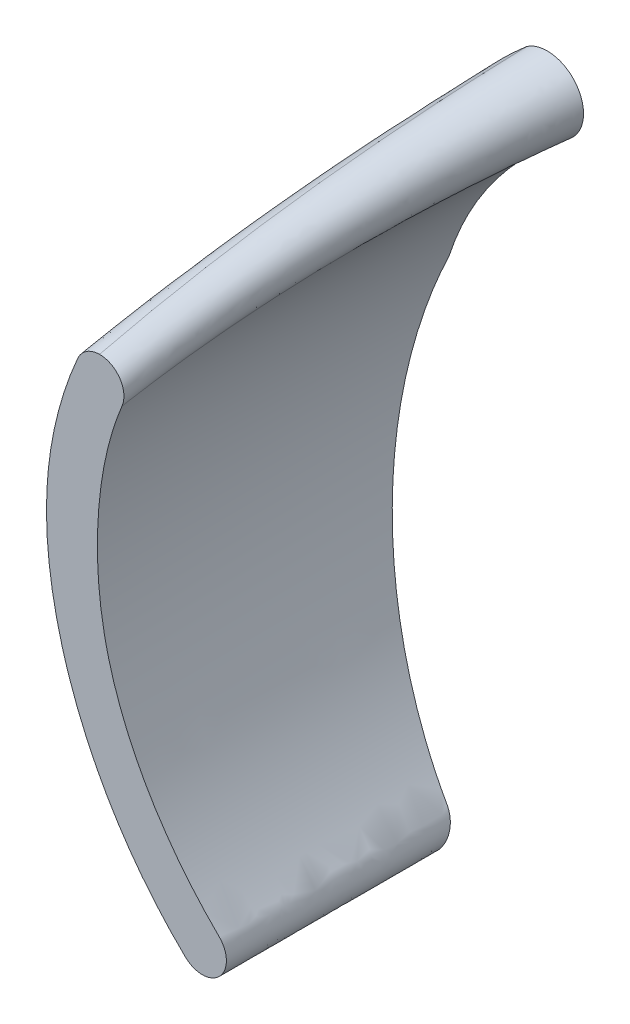
ISO-10303-21;
HEADER;
FILE_DESCRIPTION(('STEP AP214'),'2;1');
FILE_NAME('part.step','',(''),(''),'','','');
FILE_SCHEMA(('AUTOMOTIVE_DESIGN { 1 0 10303 214 1 1 1 1 }'));
ENDSEC;
DATA;
#1=APPLICATION_CONTEXT('core data for automotive mechanical design processes');
#2=APPLICATION_PROTOCOL_DEFINITION('international standard','automotive_design',2000,#1);
#3=PRODUCT_CONTEXT('',#1,'mechanical');
#4=PRODUCT('Part','Part','',(#3));
#5=PRODUCT_RELATED_PRODUCT_CATEGORY('part','',(#4));
#6=PRODUCT_DEFINITION_FORMATION('','',#4);
#7=PRODUCT_DEFINITION_CONTEXT('part definition',#1,'design');
#8=PRODUCT_DEFINITION('design','',#6,#7);
#9=PRODUCT_DEFINITION_SHAPE('','',#8);
#10=(LENGTH_UNIT() NAMED_UNIT(*) SI_UNIT(.MILLI.,.METRE.));
#11=(NAMED_UNIT(*) PLANE_ANGLE_UNIT() SI_UNIT($,.RADIAN.));
#12=(NAMED_UNIT(*) SI_UNIT($,.STERADIAN.) SOLID_ANGLE_UNIT());
#13=UNCERTAINTY_MEASURE_WITH_UNIT(LENGTH_MEASURE(1.E-05),#10,'distance_accuracy_value','');
#14=(GEOMETRIC_REPRESENTATION_CONTEXT(3) GLOBAL_UNCERTAINTY_ASSIGNED_CONTEXT((#13)) GLOBAL_UNIT_ASSIGNED_CONTEXT((#10,
#11,#12)) REPRESENTATION_CONTEXT('',''));
#15=CARTESIAN_POINT('',(0.,0.,0.));
#16=DIRECTION('',(0.,0.,1.));
#17=DIRECTION('',(1.,0.,0.));
#18=AXIS2_PLACEMENT_3D('',#15,#16,#17);
#19=CARTESIAN_POINT('',(2.21687202188998,-14.2030214101362,0.));
#20=DIRECTION('',(0.,0.,1.));
#21=DIRECTION('',(1.,0.,0.));
#22=AXIS2_PLACEMENT_3D('',#19,#20,#21);
#23=PLANE('',#22);
#24=DIRECTION('',(1.,0.,0.));
#25=VECTOR('',#24,1.);
#26=CARTESIAN_POINT('',(2.21687202188998,1.69042467703727,0.));
#27=LINE('',#26,#25);
#28=CARTESIAN_POINT('',(-3.8819149016798,1.69042465184301,4.33820491902333E-09));
#29=VERTEX_POINT('',#28);
#30=CARTESIAN_POINT('',(-1.56013684496183,1.69042461679714,8.41210645585731E-09));
#31=VERTEX_POINT('',#30);
#32=EDGE_CURVE('E165',#29,#31,#27,.T.);
#33=ORIENTED_EDGE('',*,*,#32,.F.);
#34=CARTESIAN_POINT('',(1.52540598499671,-14.9254303800577,0.));
#35=CARTESIAN_POINT('',(-5.20798473106547,-8.45325668751316,0.));
#36=CARTESIAN_POINT('',(-7.07906829862655,3.2983863051883,0.));
#37=CARTESIAN_POINT('',(1.65886001877747,10.8215877652023,0.));
#38=B_SPLINE_CURVE_WITH_KNOTS('',3,(#34,#35,#36,#37),.UNSPECIFIED.,.F.,.F.,(4,4),(0.,1.),.UNSPECIFIED.);
#39=CARTESIAN_POINT('',(0.387823292707398,9.62222518021847,0.));
#40=VERTEX_POINT('',#39);
#41=EDGE_CURVE('E152',#29,#40,#38,.T.);
#42=ORIENTED_EDGE('',*,*,#41,.T.);
#43=CARTESIAN_POINT('',(1.65886001877747,10.8215877652023,0.));
#44=CARTESIAN_POINT('',(0.995449500209707,10.2497020037202,0.));
#45=CARTESIAN_POINT('',(0.387823292707398,9.62222518021847,0.));
#46=B_SPLINE_CURVE_WITH_KNOTS('',2,(#43,#44,#45),.UNSPECIFIED.,.F.,.F.,(3,3),(0.,
0.0604558021560362),.UNSPECIFIED.);
#47=CARTESIAN_POINT('',(1.65886001877747,10.8215877652023,0.));
#48=VERTEX_POINT('',#47);
#49=EDGE_CURVE('E309',#48,#40,#46,.T.);
#50=ORIENTED_EDGE('',*,*,#49,.F.);
#51=CARTESIAN_POINT('',(2.5109062899188,9.58707686940826,0.));
#52=DIRECTION('',(0.,0.,1.));
#53=DIRECTION('',(1.,0.,0.));
#54=AXIS2_PLACEMENT_3D('',#51,#52,#53);
#55=CIRCLE('',#54,1.5);
#56=CARTESIAN_POINT('',(3.36295256106012,8.35256597361423,0.));
#57=VERTEX_POINT('',#56);
#58=EDGE_CURVE('E383',#57,#48,#55,.T.);
#59=ORIENTED_EDGE('',*,*,#58,.F.);
#60=CARTESIAN_POINT('',(2.90833805878325,-13.4806124402146,0.));
#61=CARTESIAN_POINT('',(-2.81888229836564,-7.93955339470696,0.));
#62=CARTESIAN_POINT('',(-4.96098367061801,2.05443070756396,0.));
#63=CARTESIAN_POINT('',(3.36295256106012,8.35256597361424,0.));
#64=B_SPLINE_CURVE_WITH_KNOTS('',3,(#60,#61,#62,#63),.UNSPECIFIED.,.F.,.F.,(4,4),(0.,1.),.UNSPECIFIED.);
#65=EDGE_CURVE('E214',#31,#57,#64,.T.);
#66=ORIENTED_EDGE('',*,*,#65,.F.);
#67=EDGE_LOOP('',(#33,#42,#50,#59,#66));
#68=FACE_BOUND('',#67,.T.);
#69=ADVANCED_FACE('F148',(#68),#23,.F.);
#70=CARTESIAN_POINT('',(3.09695483975418,8.77680093046163,14.));
#71=CARTESIAN_POINT('',(3.36295256106012,8.35256597361424,0.));
#72=CARTESIAN_POINT('',(2.24338395229223,8.16303354000813,14.));
#73=CARTESIAN_POINT('',(2.5260563368631,7.71934564648338,0.));
#74=CARTESIAN_POINT('',(1.07727132003301,7.07993421911677,14.));
#75=CARTESIAN_POINT('',(1.35618954109997,6.65779517127539,0.));
#76=CARTESIAN_POINT('',(-0.176649603936648,5.3794631820281,14.));
#77=CARTESIAN_POINT('',(0.0577721699250341,5.01122399532793,0.));
#78=CARTESIAN_POINT('',(-0.94652094021937,3.99168688441007,14.));
#79=CARTESIAN_POINT('',(-0.762015151465301,3.67190048743127,0.));
#80=CARTESIAN_POINT('',(-1.51667601951426,2.50959575800911,14.));
#81=CARTESIAN_POINT('',(-1.40445357046186,2.23937199883089,0.));
#82=CARTESIAN_POINT('',(-1.89196744893803,0.965970876940326,14.));
#83=CARTESIAN_POINT('',(-1.85921354343008,0.737902549588384,0.));
#84=CARTESIAN_POINT('',(-2.09652894437083,-0.608781701494442,14.));
#85=CARTESIAN_POINT('',(-2.11596552673539,-0.80824384023467,0.));
#86=CARTESIAN_POINT('',(-2.15363141823633,-2.1968936173405,14.));
#87=CARTESIAN_POINT('',(-2.18121208814721,-2.37420224861216,0.));
#88=CARTESIAN_POINT('',(-2.05653049628704,-3.78281689332909,14.));
#89=CARTESIAN_POINT('',(-2.06145579543495,-3.93510775351796,0.));
#90=CARTESIAN_POINT('',(-1.71206981463052,-5.87560706747711,14.));
#91=CARTESIAN_POINT('',(-1.67328879612149,-5.98661859099639,0.));
#92=CARTESIAN_POINT('',(-0.841451961703429,-8.39039678027985,14.));
#93=CARTESIAN_POINT('',(-0.793742398425718,-8.45227751253871,0.));
#94=CARTESIAN_POINT('',(0.776340476690976,-11.1367856006132,14.));
#95=CARTESIAN_POINT('',(0.79295937582964,-11.1628303118331,0.));
#96=CARTESIAN_POINT('',(2.15832181972896,-12.7463747640299,14.));
#97=CARTESIAN_POINT('',(2.15751829913113,-12.754197816483,0.));
#98=CARTESIAN_POINT('',(3.10189333899869,-13.6682314597512,14.));
#99=CARTESIAN_POINT('',(3.09644354137655,-13.6606608033749,0.));
#100=CARTESIAN_POINT('',(3.3260564074682,-14.1887841629831,14.));
#101=CARTESIAN_POINT('',(3.32485307122997,-14.1744049927266,0.));
#102=CARTESIAN_POINT('',(3.0103390635431,-14.9779618927495,14.));
#103=CARTESIAN_POINT('',(3.02125339240199,-14.9671168678541,0.));
#104=CARTESIAN_POINT('',(2.23074338559153,-15.3111986985058,14.));
#105=CARTESIAN_POINT('',(2.24320970084632,-15.3121071580167,0.));
#106=CARTESIAN_POINT('',(1.7081701469367,-15.10264443878,14.));
#107=CARTESIAN_POINT('',(1.71515470879549,-15.1070515994966,0.));
#108=CARTESIAN_POINT('',(0.652161863133379,-14.0870169576843,14.));
#109=CARTESIAN_POINT('',(0.651575223184542,-14.0854992507315,0.));
#110=CARTESIAN_POINT('',(-0.917225109194732,-12.2471232460665,14.));
#111=CARTESIAN_POINT('',(-0.929337819984962,-12.2307393941566,0.));
#112=CARTESIAN_POINT('',(-2.70456089285534,-9.09576697238545,14.));
#113=CARTESIAN_POINT('',(-2.73320784050167,-9.04866601730987,0.));
#114=CARTESIAN_POINT('',(-3.68150422220054,-6.2400461384842,14.));
#115=CARTESIAN_POINT('',(-3.70713592455209,-6.15809769413738,0.));
#116=CARTESIAN_POINT('',(-4.12618109492598,-3.87442481005152,14.));
#117=CARTESIAN_POINT('',(-4.12951415544986,-3.76294674027113,0.));
#118=CARTESIAN_POINT('',(-4.26908809217998,-2.07394791842353,14.));
#119=CARTESIAN_POINT('',(-4.25840320077875,-1.94409164466877,0.));
#120=CARTESIAN_POINT('',(-4.20000842887734,-0.268107199771173,14.));
#121=CARTESIAN_POINT('',(-4.18988510859001,-0.121600936325221,0.));
#122=CARTESIAN_POINT('',(-3.90568794878338,1.51552874589625,14.));
#123=CARTESIAN_POINT('',(-3.91974859083199,1.68095223083985,0.));
#124=CARTESIAN_POINT('',(-3.4046160128865,3.25310422172889,14.));
#125=CARTESIAN_POINT('',(-3.44378235945303,3.43999470290678,0.));
#126=CARTESIAN_POINT('',(-2.47570304638725,5.47888431245679,14.));
#127=CARTESIAN_POINT('',(-2.54461240348249,5.69556512798589,0.));
#128=CARTESIAN_POINT('',(-0.845987784192035,8.03960532280992,14.));
#129=CARTESIAN_POINT('',(-0.943168064576985,8.2869816307922,0.));
#130=CARTESIAN_POINT('',(0.935344399414416,9.70252527822553,14.));
#131=CARTESIAN_POINT('',(0.744159270614035,10.0340466279796,0.));
#132=CARTESIAN_POINT('',(1.92485774008341,10.3973528083549,14.));
#133=CARTESIAN_POINT('',(1.65886001877747,10.8215877652023,0.));
#134=B_SPLINE_SURFACE_WITH_KNOTS('',3,1,((#70,#71),(#72,#73),(#74,#75),(#76,#77),(#78,#79),(#80,
#81),(#82,#83),(#84,#85),(#86,#87),(#88,#89),(#90,#91),(#92,#93),(#94,#95),(#96,#97),(#98,#99),
(#100,#101),(#102,#103),(#104,#105),(#106,#107),(#108,#109),(#110,#111),(#112,#113),(#114,#115),
(#116,#117),(#118,#119),(#120,#121),(#122,#123),(#124,#125),(#126,#127),(#128,#129),(#130,#131),
(#132,#133)),.UNSPECIFIED.,.F.,.F.,.F.,(4,1,1,1,1,1,1,1,1,1,1,1,2,1,1,1,2,1,1,1,1,1,1,1,1,1,1,
4),(2,2),(0.,0.0549508721588139,0.0824263082382209,0.109901744317628,0.137377180397035,
0.164852616476442,0.192328052555849,0.219803488635256,0.247278924714663,0.27475436079407,
0.329705232952884,0.384656105111698,0.439606977270511,0.453303186760694,0.466999396250876,
0.480695605741059,0.494391815231241,0.557592838327336,0.620793861423431,0.683994884519526,
0.715595396067573,0.74719590761562,0.778796419163668,0.810396930711715,0.841997442259763,
0.87359795380781,0.936798976903905,1.),(0.,1.),.UNSPECIFIED.);
#135=CARTESIAN_POINT('',(-3.88193068715168,1.69042461659161,8.67640983804669E-09));
#136=CARTESIAN_POINT('',(-3.93156103694734,1.45353445312495,0.0710670636942164));
#137=CARTESIAN_POINT('',(-3.97580898843786,1.21565624834667,0.14243052765555));
#138=CARTESIAN_POINT('',(-4.05360997993512,0.738309715393496,0.285634489444722));
#139=CARTESIAN_POINT('',(-4.08716345661028,0.498841452550281,0.357474967673185));
#140=CARTESIAN_POINT('',(-4.17185018200345,-0.221039737936315,0.573439323838386));
#141=CARTESIAN_POINT('',(-4.20708370206866,-0.703284367769488,0.718112713322524));
#142=CARTESIAN_POINT('',(-4.22833572287485,-1.42600810827229,0.934929835652309));
#143=CARTESIAN_POINT('',(-4.23018910604345,-1.66618667073537,1.00698340434807));
#144=CARTESIAN_POINT('',(-4.22354598983349,-2.14641816558027,1.15105285276898));
#145=CARTESIAN_POINT('',(-4.2150495430569,-2.38647109859439,1.22306873268382));
#146=CARTESIAN_POINT('',(-4.17426793589974,-3.10587121255377,1.43888876688867));
#147=CARTESIAN_POINT('',(-4.12669148410282,-3.58449426121023,1.58247568147729));
#148=CARTESIAN_POINT('',(-3.99240152362667,-4.53579633424085,1.8678663033804));
#149=CARTESIAN_POINT('',(-3.90575136192566,-5.00848371170911,2.0096725166231));
#150=CARTESIAN_POINT('',(-3.69502642411673,-5.9460799758499,2.29095139586696));
#151=CARTESIAN_POINT('',(-3.57095579381771,-6.41098971818636,2.4304243185673));
#152=CARTESIAN_POINT('',(-3.28659354858567,-7.33148344942017,2.70657243793701));
#153=CARTESIAN_POINT('',(-3.12623238372661,-7.78704767501909,2.84324170561685));
#154=CARTESIAN_POINT('',(-2.77071534633855,-8.68574573921764,3.11285112487653));
#155=CARTESIAN_POINT('',(-2.57554751837671,-9.12887524600638,3.2457899769131));
#156=CARTESIAN_POINT('',(-2.20585928335007,-9.88871857591932,3.47374297588696));
#157=CARTESIAN_POINT('',(-2.03881322612188,-10.2087924115507,3.56976512657637));
#158=CARTESIAN_POINT('',(-1.68654667787473,-10.8396018007347,3.75900794333159));
#159=CARTESIAN_POINT('',(-1.50132834861582,-11.1503384593002,3.85222894090124));
#160=CARTESIAN_POINT('',(-1.11326181986739,-11.7612416250704,4.0354998906323));
#161=CARTESIAN_POINT('',(-0.910425850819215,-12.0614152650635,4.12555198263023));
#162=CARTESIAN_POINT('',(-0.487210324078142,-12.6506292917883,4.30231619064768));
#163=CARTESIAN_POINT('',(-0.266815137451634,-12.9396594127326,4.38902522693095));
#164=CARTESIAN_POINT('',(0.0764936455452713,-13.3637565936366,4.51625438120216));
#165=CARTESIAN_POINT('',(0.19306852860144,-13.5035688480949,4.55819805753963));
#166=CARTESIAN_POINT('',(0.43041239847876,-13.7799026448081,4.6410981965536));
#167=CARTESIAN_POINT('',(0.551181519775882,-13.9164240813145,4.68205462750552));
#168=CARTESIAN_POINT('',(0.796980821012679,-14.1861538470504,4.76297355722629));
#169=CARTESIAN_POINT('',(0.922015289741775,-14.3193585938279,4.80293498125953));
#170=CARTESIAN_POINT('',(1.11260914796201,-14.5164394256609,4.86205923080943));
#171=CARTESIAN_POINT('',(1.17664313206886,-14.5816744381336,4.88162973455127));
#172=CARTESIAN_POINT('',(1.30572759887699,-14.7112153189104,4.92049199878431));
#173=CARTESIAN_POINT('',(1.37077806723725,-14.7755212002985,4.9397837632007));
#174=CARTESIAN_POINT('',(1.44758868778533,-14.8503392018565,4.96222916366812));
#175=CARTESIAN_POINT('',(1.45887223694632,-14.8613021576528,4.96551805040702));
#176=CARTESIAN_POINT('',(1.48147860017345,-14.8831964567764,4.97208634014409));
#177=CARTESIAN_POINT('',(1.49280142346488,-14.894127791389,4.97536574052787));
#178=CARTESIAN_POINT('',(1.50978193215882,-14.9105165791936,4.98028237686925));
#179=CARTESIAN_POINT('',(1.51543847948053,-14.9159752444538,4.98191997644733));
#180=CARTESIAN_POINT('',(1.52679483403558,-14.9268508980341,4.9851826725214));
#181=CARTESIAN_POINT('',(1.53249463753692,-14.9322678898701,4.98680777007222));
#182=CARTESIAN_POINT('',(1.54981922636308,-14.9482867733392,4.99161343511293));
#183=CARTESIAN_POINT('',(1.56167430828259,-14.9586618547153,4.99472595952575));
#184=CARTESIAN_POINT('',(1.58578147272664,-14.9787789764175,5.00076109603643));
#185=CARTESIAN_POINT('',(1.59802945878492,-14.9885255443309,5.00368506641048));
#186=CARTESIAN_POINT('',(1.62300869250896,-15.0074437823302,5.00936053781021));
#187=CARTESIAN_POINT('',(1.63574015865803,-15.0166151874164,5.01211195933597));
#188=CARTESIAN_POINT('',(1.67461015977031,-15.0432508606577,5.02010266130872));
#189=CARTESIAN_POINT('',(1.70141741860826,-15.0598308530026,5.02507665901329));
#190=CARTESIAN_POINT('',(1.75704812958879,-15.0907612038968,5.03435576428164));
#191=CARTESIAN_POINT('',(1.78589926413242,-15.1050658510107,5.03864715841478));
#192=CARTESIAN_POINT('',(1.84489353200634,-15.1309408835829,5.04640966818565));
#193=CARTESIAN_POINT('',(1.87503663887886,-15.1425113250023,5.04988080061172));
#194=CARTESIAN_POINT('',(1.967416556185,-15.1730447551992,5.05904082967122));
#195=CARTESIAN_POINT('',(2.03130975685837,-15.1876660673883,5.06342722332774));
#196=CARTESIAN_POINT('',(2.151541907197,-15.2028702998251,5.06798849305865));
#197=CARTESIAN_POINT('',(2.207652016346,-15.2051640562396,5.06867661998303));
#198=CARTESIAN_POINT('',(2.31919606817882,-15.1998571077204,5.06708453542731));
#199=CARTESIAN_POINT('',(2.37463156785573,-15.192287056439,5.06481352004292));
#200=CARTESIAN_POINT('',(2.47996393807848,-15.1689354236419,5.05780803020371));
#201=CARTESIAN_POINT('',(2.52999226286433,-15.1536838541134,5.05323255934508));
#202=CARTESIAN_POINT('',(2.62702684165603,-15.1159034977006,5.04189845242145));
#203=CARTESIAN_POINT('',(2.67402879559371,-15.0933646187037,5.03513678872265));
#204=CARTESIAN_POINT('',(2.76714796069172,-15.0396929945535,5.01903530147768));
#205=CARTESIAN_POINT('',(2.81295019759684,-15.0080530653101,5.00954332270444));
#206=CARTESIAN_POINT('',(2.87693324665003,-14.9554422351849,4.99376007366653));
#207=CARTESIAN_POINT('',(2.89747414689521,-14.9370468774716,4.98824146635241));
#208=CARTESIAN_POINT('',(2.93681556944659,-14.8986215924574,4.97671388084864));
#209=CARTESIAN_POINT('',(2.95561620751649,-14.8785917740492,4.97070493532681));
#210=CARTESIAN_POINT('',(3.00895965154082,-14.8166560895981,4.95212422999217));
#211=CARTESIAN_POINT('',(3.04081857907113,-14.7725937174113,4.93890551833496));
#212=CARTESIAN_POINT('',(3.09697474949556,-14.6802549595961,4.91120389098962));
#213=CARTESIAN_POINT('',(3.12126462256807,-14.6319745251191,4.89671976064688));
#214=CARTESIAN_POINT('',(3.16328906288271,-14.5292672841492,4.86590758835614));
#215=CARTESIAN_POINT('',(3.18050341952463,-14.4746448713167,4.84952086450625));
#216=CARTESIAN_POINT('',(3.20556986238651,-14.3633848726876,4.81614286491741));
#217=CARTESIAN_POINT('',(3.2134151235148,-14.3067458487455,4.79915115773483));
#218=CARTESIAN_POINT('',(3.21771478727125,-14.2203817145437,4.77324191747429));
#219=CARTESIAN_POINT('',(3.21783022901024,-14.1907945024959,4.76436575385994));
#220=CARTESIAN_POINT('',(3.21529998783258,-14.1317335046202,4.74664745449724));
#221=CARTESIAN_POINT('',(3.21265432878404,-14.1022597178141,4.73780531845541));
#222=CARTESIAN_POINT('',(3.20075992531802,-14.014530439301,4.71148653490148));
#223=CARTESIAN_POINT('',(3.18756523271491,-13.9567097553036,4.69414032970226));
#224=CARTESIAN_POINT('',(3.16068224160465,-13.8730233135307,4.66903439717039));
#225=CARTESIAN_POINT('',(3.15072184535176,-13.8459856766038,4.66092310609231));
#226=CARTESIAN_POINT('',(3.12854693146675,-13.7927660018305,4.64495720366032));
#227=CARTESIAN_POINT('',(3.11633317514362,-13.7665836785182,4.63710250666664));
#228=CARTESIAN_POINT('',(3.09634728284662,-13.7280475947454,4.6255416815348));
#229=CARTESIAN_POINT('',(3.08939100585177,-13.7152985097231,4.62171695602811));
#230=CARTESIAN_POINT('',(3.07493181731485,-13.6900824675157,4.61415214336588));
#231=CARTESIAN_POINT('',(3.06742877180344,-13.6776155804621,4.6104120772498));
#232=CARTESIAN_POINT('',(3.05188741318668,-13.652995810457,4.60302614624827));
#233=CARTESIAN_POINT('',(3.04384922130242,-13.6408428572532,4.59938026028713));
#234=CARTESIAN_POINT('',(3.02724821407733,-13.6168811491789,4.59219174786484));
#235=CARTESIAN_POINT('',(3.01868573232202,-13.6050721823592,4.58864905781895));
#236=CARTESIAN_POINT('',(3.0010450574758,-13.581821146362,4.58167374701978));
#237=CARTESIAN_POINT('',(2.99196711046321,-13.5703789061269,4.57824107494923));
#238=CARTESIAN_POINT('',(2.97329733449603,-13.5478920830612,4.57149502802952));
#239=CARTESIAN_POINT('',(2.9637056598417,-13.5368473824759,4.56818161785395));
#240=CARTESIAN_POINT('',(2.94401940236445,-13.515141846663,4.56166995711008));
#241=CARTESIAN_POINT('',(2.93392400226607,-13.5044816870199,4.55847190921715));
#242=CARTESIAN_POINT('',(2.91836231176066,-13.4888731446788,4.55378934651481));
#243=CARTESIAN_POINT('',(2.91310426345356,-13.4837329601713,4.55224729116256));
#244=CARTESIAN_POINT('',(2.90256347789905,-13.473475726724,4.54917012112838));
#245=CARTESIAN_POINT('',(2.89728073901662,-13.4683586793618,4.54763500691972));
#246=CARTESIAN_POINT('',(2.88141165168352,-13.452950961977,4.54301269170427));
#247=CARTESIAN_POINT('',(2.87084438033189,-13.4426421375261,4.53992004436902));
#248=CARTESIAN_POINT('',(2.84973360143887,-13.422005961004,4.53372919141239));
#249=CARTESIAN_POINT('',(2.83919008996,-13.4116786126044,4.5306309868925));
#250=CARTESIAN_POINT('',(2.80761819926604,-13.3806707515413,4.52132862857358));
#251=CARTESIAN_POINT('',(2.78663322939607,-13.359949620757,4.51511228933828));
#252=CARTESIAN_POINT('',(2.74470542456278,-13.3183370709654,4.50262852440079));
#253=CARTESIAN_POINT('',(2.72376295270776,-13.2974453165036,4.49636099806224));
#254=CARTESIAN_POINT('',(2.68198622869995,-13.2555530704932,4.48379332425913));
#255=CARTESIAN_POINT('',(2.66115200401767,-13.234552553808,4.47749316925358));
#256=CARTESIAN_POINT('',(2.61959038635596,-13.1924423410282,4.46486010541964));
#257=CARTESIAN_POINT('',(2.5988630287436,-13.1713326129079,4.45852718698354));
#258=CARTESIAN_POINT('',(2.55752369592837,-13.1290126428866,4.44583119597716));
#259=CARTESIAN_POINT('',(2.53691171255312,-13.1078024083066,4.43946812560315));
#260=CARTESIAN_POINT('',(2.47502639430779,-13.0437914877412,4.42026484943354));
#261=CARTESIAN_POINT('',(2.43392670962347,-13.0008365414542,4.40737836554742));
#262=CARTESIAN_POINT('',(2.35223635877426,-12.9145695565787,4.38149827008478));
#263=CARTESIAN_POINT('',(2.31164519119733,-12.8712579533359,4.36850478911196));
#264=CARTESIAN_POINT('',(2.23095399629915,-12.7842638787072,4.34240656672332));
#265=CARTESIAN_POINT('',(2.19085368524571,-12.7405816489386,4.32930189779275));
#266=CARTESIAN_POINT('',(2.11112808883237,-12.6528327853144,4.30297723870551));
#267=CARTESIAN_POINT('',(2.07150273882278,-12.6087662052188,4.28975726467682));
#268=CARTESIAN_POINT('',(1.87404363646697,-12.3868951863135,4.22319595900526));
#269=CARTESIAN_POINT('',(1.71975947879259,-12.2061670125438,4.16897750687433));
#270=CARTESIAN_POINT('',(1.41896196253849,-11.8388595599809,4.05878527110543));
#271=CARTESIAN_POINT('',(1.27244936867042,-11.652279708254,4.00281131558736));
#272=CARTESIAN_POINT('',(0.987346098276317,-11.2736210706456,3.88921372430486));
#273=CARTESIAN_POINT('',(0.848756090082311,-11.0815418228924,3.83158994997889));
#274=CARTESIAN_POINT('',(0.579708146123061,-10.6922156343867,3.71479209342718));
#275=CARTESIAN_POINT('',(0.449250571331696,-10.4949684647971,3.65561794255032));
#276=CARTESIAN_POINT('',(0.195524218880521,-10.093619860539,3.53521336127288));
#277=CARTESIAN_POINT('',(0.0723386983360411,-9.88947011271803,3.47396843692658));
#278=CARTESIAN_POINT('',(-0.165190600419063,-9.47641920623661,3.35005316498216));
#279=CARTESIAN_POINT('',(-0.27953154007874,-9.26751654980163,3.28738236805166));
#280=CARTESIAN_POINT('',(-0.4990606091574,-8.84530267325969,3.16071820508909));
#281=CARTESIAN_POINT('',(-0.604247370405391,-8.63199080003286,3.09672464312104));
#282=CARTESIAN_POINT('',(-0.805176546823992,-8.20132055689171,2.96752357017869));
#283=CARTESIAN_POINT('',(-0.900918646380428,-7.98396205203861,2.90231601872276));
#284=CARTESIAN_POINT('',(-1.11342557622641,-7.47122226356848,2.74849408218172));
#285=CARTESIAN_POINT('',(-1.22632129341566,-7.17435932121198,2.65943519947477));
#286=CARTESIAN_POINT('',(-1.43376139124177,-6.57487004768786,2.47958841741754));
#287=CARTESIAN_POINT('',(-1.52830921193802,-6.27224480860387,2.38880084569234));
#288=CARTESIAN_POINT('',(-1.69822302133437,-5.66205930424865,2.20574519438577));
#289=CARTESIAN_POINT('',(-1.77358775484731,-5.35449871744688,2.11347701834524));
#290=CARTESIAN_POINT('',(-1.90376296503798,-4.73880308403843,1.92876832832271));
#291=CARTESIAN_POINT('',(-1.95878291353606,-4.43070870842427,1.83634001563846));
#292=CARTESIAN_POINT('',(-2.04879318195908,-3.81183235631629,1.65067711000607));
#293=CARTESIAN_POINT('',(-2.08378335155631,-3.50105035966907,1.5574425110119));
#294=CARTESIAN_POINT('',(-2.13279041624888,-2.87803707355278,1.37053852517701));
#295=CARTESIAN_POINT('',(-2.14681279425864,-2.56580618438698,1.27686925842727));
#296=CARTESIAN_POINT('',(-2.15308375389822,-1.92240680596519,1.08384944490074));
#297=CARTESIAN_POINT('',(-2.14397722136718,-1.59122467630184,0.98449480600173));
#298=CARTESIAN_POINT('',(-2.10030444217498,-0.930418683051608,0.786253008026662));
#299=CARTESIAN_POINT('',(-2.06574248983131,-0.600794566067141,0.687365772931322));
#300=CARTESIAN_POINT('',(-1.98562316746779,-0.0514552846758967,0.522563988513949));
#301=CARTESIAN_POINT('',(-1.94726692399326,0.169235332400895,0.456356803390913));
#302=CARTESIAN_POINT('',(-1.880416182419,0.498563152890543,0.357558457244018));
#303=CARTESIAN_POINT('',(-1.85657387432419,0.608077274018403,0.32470422090566));
#304=CARTESIAN_POINT('',(-1.80574537681061,0.826442497842438,0.259194653758449));
#305=CARTESIAN_POINT('',(-1.77875902115208,0.935293565159512,0.226539333563327));
#306=CARTESIAN_POINT('',(-1.72163185855115,1.15235642796074,0.161420474722958));
#307=CARTESIAN_POINT('',(-1.69148772075165,1.26056741860318,0.128957177530226));
#308=CARTESIAN_POINT('',(-1.62809483052641,1.47614700051606,0.0642833029563627));
#309=CARTESIAN_POINT('',(-1.59484620747123,1.58351562668768,0.0320727151048777));
#310=CARTESIAN_POINT('',(-1.56005712270495,1.69042462095656,1.68242129117146E-08));
#311=B_SPLINE_CURVE_WITH_KNOTS('',3,(#135,#136,#137,#138,#139,#140,#141,#142,#143,#144,#145,
#146,#147,#148,#149,#150,#151,#152,#153,#154,#155,#156,#157,#158,#159,#160,#161,#162,#163,#164,
#165,#166,#167,#168,#169,#170,#171,#172,#173,#174,#175,#176,#177,#178,#179,#180,#181,#182,#183,
#184,#185,#186,#187,#188,#189,#190,#191,#192,#193,#194,#195,#196,#197,#198,#199,#200,#201,#202,
#203,#204,#205,#206,#207,#208,#209,#210,#211,#212,#213,#214,#215,#216,#217,#218,#219,#220,#221,
#222,#223,#224,#225,#226,#227,#228,#229,#230,#231,#232,#233,#234,#235,#236,#237,#238,#239,#240,
#241,#242,#243,#244,#245,#246,#247,#248,#249,#250,#251,#252,#253,#254,#255,#256,#257,#258,#259,
#260,#261,#262,#263,#264,#265,#266,#267,#268,#269,#270,#271,#272,#273,#274,#275,#276,#277,#278,
#279,#280,#281,#282,#283,#284,#285,#286,#287,#288,#289,#290,#291,#292,#293,#294,#295,#296,#297,
#298,#299,#300,#301,#302,#303,#304,#305,#306,#307,#308,#309,#310),.UNSPECIFIED.,.F.,.F.,(4,2,2,
2,2,2,2,2,2,2,2,2,2,2,2,2,2,2,2,2,2,2,2,2,2,2,2,2,2,2,2,2,2,2,2,2,2,2,2,2,2,2,2,2,2,2,2,2,2,2,2,
2,2,2,2,2,2,2,2,2,2,2,2,2,2,2,2,2,2,2,2,2,2,2,2,2,2,2,2,2,2,2,2,2,2,2,2,4),(0.,
0.756602191804383,1.51317348666273,3.02518488234467,3.77729889934332,4.52940909381504,
6.03352155097737,7.53520423329591,9.03672060545877,10.5411393395052,12.0460758117664,
13.1663267283791,14.2864445419788,15.4057908741219,16.5261448786667,17.086497741973,
17.6468685879698,18.2078205305665,18.4882594759858,18.768694468414,18.8169116456494,
18.8651410412582,18.8892301821737,18.9133172678614,18.9614688980581,19.0092221139308,
19.0569971723185,19.1525745320059,19.2498792506961,19.3471819776736,19.54279176269,
19.7103829469021,19.8774545498427,20.0343175859735,20.1913987971938,20.3599452055238,
20.4442178065964,20.5284847977496,20.69555279129,20.8627829506091,21.0407362471749,
21.218819098204,21.3113771596488,21.4039344209896,21.588252865073,21.6779864168316,
21.7676897069945,21.8127355655254,21.857792498554,21.9028392598074,21.9478576515092,
21.9928547296428,22.0378383676872,22.0828975267571,22.1054357900143,22.1279755675173,
22.1732249583712,22.2184661989713,22.3088835791865,22.3995970962473,22.490332608025,
22.5810964349557,22.6718537492666,22.8543422398466,23.0366338118912,23.2188144994922,
23.4009701012014,24.1319392087615,24.8629801097999,25.5940825891239,26.3252174967809,
27.0635383562072,27.8020951951812,28.5407622289581,29.2794539385651,30.2684449746026,
31.2572504045188,32.2461205172991,33.2245052328295,34.2028972912475,35.1810334629837,
36.2177829841135,37.2543576461299,37.9547582665452,38.3051060549601,38.655472376234,
39.0062120610886,39.3569371363877),.UNSPECIFIED.);
#312=EDGE_CURVE('E13',#29,#31,#311,.T.);
#313=CARTESIAN_POINT('',(3.36295256106012,8.35256597361423,0.));
#314=CARTESIAN_POINT('',(3.24570628385229,8.27566411063696,0.264188601804346));
#315=CARTESIAN_POINT('',(3.12987709467726,8.19796704731865,0.528773571325038));
#316=CARTESIAN_POINT('',(2.90125240418028,8.04088665601517,1.05875855844085));
#317=CARTESIAN_POINT('',(2.78845696272793,7.96150329480696,1.32415859200589));
#318=CARTESIAN_POINT('',(2.45492072854715,7.72067974100648,2.1216150524837));
#319=CARTESIAN_POINT('',(2.23903708395103,7.55657068034693,2.65491199225704));
#320=CARTESIAN_POINT('',(1.82144045895922,7.22080008589719,3.72463821947577));
#321=CARTESIAN_POINT('',(1.61972678330209,7.04913892333028,4.2610673518367));
#322=CARTESIAN_POINT('',(1.23125843688618,6.69805135574887,5.33680059482519));
#323=CARTESIAN_POINT('',(1.04450384727725,6.51862490861748,5.87610472103206));
#324=CARTESIAN_POINT('',(0.658264275969131,6.12313695761342,7.04226658526547));
#325=CARTESIAN_POINT('',(0.461400704137618,5.90575364217563,7.66954703472187));
#326=CARTESIAN_POINT('',(0.0888398406436708,5.46070378352873,8.92671023317546));
#327=CARTESIAN_POINT('',(-0.086858117237806,5.23303756429956,9.5565928996182));
#328=CARTESIAN_POINT('',(-0.417238464079318,4.76633046136023,10.8213659421035));
#329=CARTESIAN_POINT('',(-0.571814824116752,4.52723977768479,11.4562657905498));
#330=CARTESIAN_POINT('',(-0.786277774528186,4.16073016632732,12.4095465555435));
#331=CARTESIAN_POINT('',(-0.854871871211548,4.03723375060651,12.7274976592097));
#332=CARTESIAN_POINT('',(-0.953279461850344,3.85000049519714,13.2045809091227));
#333=CARTESIAN_POINT('',(-0.985335848749589,3.78725558608031,13.3636407136476));
#334=CARTESIAN_POINT('',(-1.04796080419597,3.66111327276412,13.681796863583));
#335=CARTESIAN_POINT('',(-1.07852935424201,3.59771586046282,13.8408932094233));
#336=CARTESIAN_POINT('',(-1.1083574585379,3.53399743876728,14.));
#337=B_SPLINE_CURVE_WITH_KNOTS('',3,(#313,#314,#315,#316,#317,#318,#319,#320,#321,#322,#323,
#324,#325,#326,#327,#328,#329,#330,#331,#332,#333,#334,#335,#336),.UNSPECIFIED.,.F.,.F.,(4,2,2,
2,2,2,2,2,2,2,2,4),(0.,0.897268864680289,1.79455542356624,3.58918236951805,5.38372119899819,
7.17826976281174,9.25521688909343,11.3320986232974,13.4190505425236,14.4627604544224,
14.9846544739026,15.5065549814268),.UNSPECIFIED.);
#338=CARTESIAN_POINT('',(-1.07023229958837,3.61442564658686,13.798746443061));
#339=VERTEX_POINT('',#338);
#340=EDGE_CURVE('E376',#57,#339,#337,.T.);
#341=CARTESIAN_POINT('',(-1.10836820608257,3.5340019171105,14.));
#342=VERTEX_POINT('',#341);
#343=EDGE_CURVE('E224',#339,#342,#337,.T.);
#344=CARTESIAN_POINT('',(2.91293649133701,-13.4850421246596,14.));
#345=CARTESIAN_POINT('',(0.771761647534717,-11.3891168398413,14.));
#346=CARTESIAN_POINT('',(-1.83912121584627,-7.23173171228272,14.));
#347=CARTESIAN_POINT('',(-2.31868800175319,-0.992758489949872,14.));
#348=CARTESIAN_POINT('',(-1.2342069465496,4.40344367469161,14.));
#349=CARTESIAN_POINT('',(1.26295610351334,7.45804857494887,14.));
#350=CARTESIAN_POINT('',(3.09695483975418,8.77680093046163,14.));
#351=B_SPLINE_CURVE_WITH_KNOTS('',3,(#344,#345,#346,#347,#348,#349,#350),.UNSPECIFIED.,.F.,.F.,
(4,1,1,1,4),(0.,0.358375148978437,0.552921506273542,0.731464737862572,1.),.UNSPECIFIED.);
#352=CARTESIAN_POINT('',(2.9136457929253,-13.4843161368379,14.));
#353=VERTEX_POINT('',#352);
#354=EDGE_CURVE('E424',#353,#342,#351,.T.);
#355=CARTESIAN_POINT('',(2.21687202188998,-14.2030214101362,14.));
#356=DIRECTION('',(0.,0.,1.));
#357=DIRECTION('',(1.,0.,0.));
#358=AXIS2_PLACEMENT_3D('',#355,#356,#357);
#359=CIRCLE('',#358,1.);
#360=CARTESIAN_POINT('',(1.52008524046069,-14.9217517291973,14.));
#361=VERTEX_POINT('',#360);
#362=EDGE_CURVE('E172',#361,#353,#359,.T.);
#363=CARTESIAN_POINT('',(1.92485774008341,10.3973528083549,14.));
#364=CARTESIAN_POINT('',(-0.245031570646352,8.87367569510937,14.));
#365=CARTESIAN_POINT('',(-2.9850625658103,5.31842949961962,14.));
#366=CARTESIAN_POINT('',(-4.54814241621797,-0.834771117861485,14.));
#367=CARTESIAN_POINT('',(-3.67728763924329,-7.8900099329512,14.));
#368=CARTESIAN_POINT('',(-0.920950237086708,-12.5766774421969,14.));
#369=CARTESIAN_POINT('',(1.52080755244295,-14.9210006956127,14.));
#370=B_SPLINE_CURVE_WITH_KNOTS('',3,(#363,#364,#365,#366,#367,#368,#369),.UNSPECIFIED.,.F.,.F.,
(4,1,1,1,4),(0.,0.273226648059328,0.453803234052197,0.647928626033516,1.),.UNSPECIFIED.);
#371=CARTESIAN_POINT('',(-2.94826775626233,4.31919374707067,14.));
#372=VERTEX_POINT('',#371);
#373=EDGE_CURVE('E436',#372,#361,#370,.T.);
#374=CARTESIAN_POINT('',(-2.94812987538787,4.31913441260107,14.));
#375=CARTESIAN_POINT('',(-2.84716781917716,4.564254972901,13.4001700865361));
#376=CARTESIAN_POINT('',(-2.74088222161241,4.80711839838385,12.8003095220372));
#377=CARTESIAN_POINT('',(-2.5175297566406,5.28816673975544,11.6007497315461));
#378=CARTESIAN_POINT('',(-2.40046333252993,5.52635184752356,11.0010504999362));
#379=CARTESIAN_POINT('',(-2.15540514747151,5.99790257351072,9.80197883079187));
#380=CARTESIAN_POINT('',(-2.02741324357075,6.23126812861931,9.20260639763675));
#381=CARTESIAN_POINT('',(-1.76050837411173,6.69308982334311,8.00437928072662));
#382=CARTESIAN_POINT('',(-1.62159506097369,6.92154580641364,7.40552461406352));
#383=CARTESIAN_POINT('',(-1.34016082811109,7.36233254480652,6.23817163875805));
#384=CARTESIAN_POINT('',(-1.19815889742376,7.57490170960868,5.66963810097822));
#385=CARTESIAN_POINT('',(-0.904699959375092,7.99562611007406,4.53335961583401));
#386=CARTESIAN_POINT('',(-0.753242656901574,8.20378120769766,3.96561469364907));
#387=CARTESIAN_POINT('',(-0.441392225784386,8.6158620108094,2.83099056475328));
#388=CARTESIAN_POINT('',(-0.280998359832184,8.81978736541345,2.26411143345023));
#389=CARTESIAN_POINT('',(-0.0344122218019856,9.12276604877885,1.41452282078492));
#390=CARTESIAN_POINT('',(0.0487802809558183,9.2232716387156,1.13145518451682));
#391=CARTESIAN_POINT('',(0.217018866007861,9.42337921580804,0.565554205339648));
#392=CARTESIAN_POINT('',(0.302064932354825,9.52298121072746,0.282720860436543));
#393=CARTESIAN_POINT('',(0.387965494407238,9.62216449444012,4.09222122854658E-09));
#394=B_SPLINE_CURVE_WITH_KNOTS('',3,(#374,#375,#376,#377,#378,#379,#380,#381,#382,#383,#384,
#385,#386,#387,#388,#389,#390,#391,#392,#393),.UNSPECIFIED.,.F.,.F.,(4,2,2,2,2,2,2,2,2,4),(0.,
1.96737978783396,3.93467871514465,5.90200338726897,7.86939069593407,9.73938778098295,
11.6094432598306,13.4796532561837,14.4147126953869,15.3497640929088),.UNSPECIFIED.);
#395=CARTESIAN_POINT('',(-2.84963618264651,4.55359939009457,13.4245867798739));
#396=VERTEX_POINT('',#395);
#397=EDGE_CURVE('E318',#372,#396,#394,.T.);
#398=CARTESIAN_POINT('',(-2.94826775626233,4.31919374707067,14.));
#399=CARTESIAN_POINT('',(-2.16030044641487,6.23207585969513,9.31895417825866));
#400=CARTESIAN_POINT('',(-1.02231687135337,7.99371660102761,4.64179975119774));
#401=CARTESIAN_POINT('',(0.387823292707398,9.62222518021847,0.));
#402=B_SPLINE_CURVE_WITH_KNOTS('',3,(#398,#399,#400,#401),.UNSPECIFIED.,.F.,.F.,(4,4),(0.,1.),.UNSPECIFIED.);
#403=CARTESIAN_POINT('',(0.253458499579486,9.46565660711994,0.44521874571532));
#404=VERTEX_POINT('',#403);
#405=EDGE_CURVE('E158',#404,#396,#402,.F.);
#406=EDGE_CURVE('E222',#404,#40,#394,.T.);
#407=ORIENTED_EDGE('',*,*,#41,.F.);
#408=ORIENTED_EDGE('',*,*,#312,.T.);
#409=ORIENTED_EDGE('',*,*,#65,.T.);
#410=ORIENTED_EDGE('',*,*,#340,.T.);
#411=ORIENTED_EDGE('',*,*,#343,.T.);
#412=ORIENTED_EDGE('',*,*,#354,.F.);
#413=ORIENTED_EDGE('',*,*,#362,.F.);
#414=ORIENTED_EDGE('',*,*,#373,.F.);
#415=ORIENTED_EDGE('',*,*,#397,.T.);
#416=ORIENTED_EDGE('',*,*,#405,.F.);
#417=ORIENTED_EDGE('',*,*,#406,.T.);
#418=EDGE_LOOP('',(#407,#408,#409,#410,#411,#412,#413,#414,#415,#416,#417));
#419=FACE_BOUND('',#418,.T.);
#420=ADVANCED_FACE('F220',(#419),#134,.T.);
#421=CARTESIAN_POINT('',(-2.1276792531785,-2.21370417975782,14.));
#422=DIRECTION('',(0.,0.,-1.));
#423=DIRECTION('',(-1.,0.,0.));
#424=AXIS2_PLACEMENT_3D('',#421,#422,#423);
#425=PLANE('',#424);
#426=ORIENTED_EDGE('',*,*,#354,.T.);
#427=CARTESIAN_POINT('',(-2.02831805057569,3.92659766946154,14.));
#428=DIRECTION('',(0.,0.,1.));
#429=DIRECTION('',(1.,0.,0.));
#430=AXIS2_PLACEMENT_3D('',#427,#428,#429);
#431=CIRCLE('',#430,1.00021954647318);
#432=CARTESIAN_POINT('',(-2.03934400879632,4.92675644155341,14.));
#433=VERTEX_POINT('',#432);
#434=EDGE_CURVE('E385',#342,#433,#431,.T.);
#435=ORIENTED_EDGE('',*,*,#434,.T.);
#436=EDGE_CURVE('E216',#433,#372,#431,.T.);
#437=ORIENTED_EDGE('',*,*,#436,.T.);
#438=ORIENTED_EDGE('',*,*,#373,.T.);
#439=ORIENTED_EDGE('',*,*,#362,.T.);
#440=EDGE_LOOP('',(#426,#435,#437,#438,#439));
#441=FACE_BOUND('',#440,.T.);
#442=ADVANCED_FACE('F249',(#441),#425,.F.);
#443=CARTESIAN_POINT('',(-2.03934400879632,4.92675644155341,14.));
#444=CARTESIAN_POINT('',(-1.21932516528678,7.08235940664554,9.30309332923865));
#445=CARTESIAN_POINT('',(0.052321336060584,9.03936876820076,4.61837932024888));
#446=CARTESIAN_POINT('',(1.65886001877747,10.8215877652023,0.));
#447=CARTESIAN_POINT('',(-1.95661509953243,4.92766846224716,14.));
#448=CARTESIAN_POINT('',(-1.11825705804054,7.12422119224228,9.30167096130322));
#449=CARTESIAN_POINT('',(0.18084093953755,9.11793386904755,4.61627902473672));
#450=CARTESIAN_POINT('',(1.82045711586306,10.9331203603929,0.));
#451=CARTESIAN_POINT('',(-1.79096841588311,4.90857500077977,14.));
#452=CARTESIAN_POINT('',(-0.901260556383558,7.17257918351611,9.29882622543235));
#453=CARTESIAN_POINT('',(0.467411855698944,9.22525041375672,4.61207843371241));
#454=CARTESIAN_POINT('',(2.18785444128468,11.0919238167251,0.));
#455=CARTESIAN_POINT('',(-1.55685784578772,4.8207154847717,14.));
#456=CARTESIAN_POINT('',(-0.568861919454755,7.12924616674376,9.29455912162605));
#457=CARTESIAN_POINT('',(0.925435454206292,9.21370454726125,4.60577754717595));
#458=CARTESIAN_POINT('',(2.78838099350428,11.100957637788,0.));
#459=CARTESIAN_POINT('',(-1.35203278181411,4.67716982971429,14.));
#460=CARTESIAN_POINT('',(-0.270097255300613,6.97197540982351,9.29029201781974));
#461=CARTESIAN_POINT('',(1.3454766132861,9.02996933951932,4.59947666063948));
#462=CARTESIAN_POINT('',(3.34657663964346,10.8795505165058,0.));
#463=CARTESIAN_POINT('',(-1.18798334645555,4.48831279009947,14.));
#464=CARTESIAN_POINT('',(-0.0409035790191783,6.71889682411294,9.28602491401344));
#465=CARTESIAN_POINT('',(1.66715142523553,8.69992985875417,4.59317577410301));
#466=CARTESIAN_POINT('',(3.7776105793946,10.4613426779675,0.));
#467=CARTESIAN_POINT('',(-1.07619966220527,4.26451912041918,14.));
#468=CARTESIAN_POINT('',(0.0891479370868425,6.39814913187583,9.28175781020714));
#469=CARTESIAN_POINT('',(1.84280766794243,8.26948879500141,4.58687488756654));
#470=CARTESIAN_POINT('',(4.0157495408361,9.91000077998059,0.));
#471=CARTESIAN_POINT('',(-1.02187498587923,4.02037266547927,14.));
#472=CARTESIAN_POINT('',(0.104524089643302,6.04746861913678,9.27749070640084));
#473=CARTESIAN_POINT('',(1.84657219147444,7.7995348755044,4.58057400103008));
#474=CARTESIAN_POINT('',(4.02478042747737,9.30956599100707,0.));
#475=CARTESIAN_POINT('',(-1.03020257429336,3.77045727008561,14.));
#476=CARTESIAN_POINT('',(0.00130763292860751,5.70699360815389,9.27322360259453));
#477=CARTESIAN_POINT('',(1.67580376120431,7.35576089997344,4.57427311449361));
#478=CARTESIAN_POINT('',(3.80333801578551,8.7512855882095,0.));
#479=CARTESIAN_POINT('',(-1.075894343652,3.6100962826613,14.));
#480=CARTESIAN_POINT('',(-0.137983395106857,5.51250975687752,9.27037886672366));
#481=CARTESIAN_POINT('',(1.46113807098878,7.11866128553913,4.5700725234693));
#482=CARTESIAN_POINT('',(3.52454965814572,8.46409856880489,0.));
#483=CARTESIAN_POINT('',(-1.10836820608257,3.5340019171105,14.));
#484=CARTESIAN_POINT('',(-0.221448533713988,5.42867888818412,9.26895649878823));
#485=CARTESIAN_POINT('',(1.33579395445346,7.0228474640502,4.56797222795714));
#486=CARTESIAN_POINT('',(3.36295256106012,8.35256597361423,0.));
#487=CARTESIAN_POINT('',(-1.11096611507702,3.52791436786643,14.));
#488=CARTESIAN_POINT('',(-0.228125744802558,5.42197241868865,9.2688427093534));
#489=CARTESIAN_POINT('',(1.32576642513064,7.01518235833108,4.56780420431617));
#490=CARTESIAN_POINT('',(3.35002479329327,8.34364336599898,0.));
#491=CARTESIAN_POINT('',(-1.11356402407146,3.52182681862237,14.));
#492=CARTESIAN_POINT('',(-0.234802955891129,5.41526594919318,9.26872891991856));
#493=CARTESIAN_POINT('',(1.31573889580781,7.00751725261197,4.5676361806752));
#494=CARTESIAN_POINT('',(3.33709702552642,8.33472075838373,0.));
#495=CARTESIAN_POINT('',(-1.11616193306591,3.5157392693783,14.));
#496=CARTESIAN_POINT('',(-0.241480166979699,5.40855947969771,9.26861513048373));
#497=CARTESIAN_POINT('',(1.30571136648499,6.99985214689285,4.56746815703423));
#498=CARTESIAN_POINT('',(3.32416925775958,8.32579815076848,0.));
#499=B_SPLINE_SURFACE_WITH_KNOTS('',3,3,((#443,#444,#445,#446),(#447,#448,#449,#450),(#451,#452,
#453,#454),(#455,#456,#457,#458),(#459,#460,#461,#462),(#463,#464,#465,#466),(#467,#468,#469,
#470),(#471,#472,#473,#474),(#475,#476,#477,#478),(#479,#480,#481,#482),(#483,#484,#485,#486),
(#487,#488,#489,#490),(#491,#492,#493,#494),(#495,#496,#497,#498)),.UNSPECIFIED.,.F.,.F.,.F.,(4,
1,1,1,1,1,1,1,3,4),(4,4),(0.317231703311241,0.402577740397336,0.487923777483431,
0.573269814569525,0.65861585165562,0.743961888741715,0.82930792582781,0.914653962913905,1.,
1.00682768296689),(0.,1.),.UNSPECIFIED.);
#500=CARTESIAN_POINT('',(-2.03934400879632,4.92675644155341,14.));
#501=CARTESIAN_POINT('',(-1.21932516528678,7.08235940664554,9.30309332923865));
#502=CARTESIAN_POINT('',(0.052321336060584,9.03936876820076,4.61837932024888));
#503=CARTESIAN_POINT('',(1.65886001877747,10.8215877652023,0.));
#504=B_SPLINE_CURVE_WITH_KNOTS('',3,(#500,#501,#502,#503),.UNSPECIFIED.,.F.,.F.,(4,4),(0.,1.),.UNSPECIFIED.);
#505=EDGE_CURVE('E468',#433,#48,#504,.T.);
#506=ORIENTED_EDGE('',*,*,#434,.F.);
#507=ORIENTED_EDGE('',*,*,#343,.F.);
#508=ORIENTED_EDGE('',*,*,#340,.F.);
#509=ORIENTED_EDGE('',*,*,#58,.T.);
#510=ORIENTED_EDGE('',*,*,#505,.F.);
#511=EDGE_LOOP('',(#506,#507,#508,#509,#510));
#512=FACE_BOUND('',#511,.T.);
#513=ADVANCED_FACE('F341',(#512),#499,.T.);
#514=CARTESIAN_POINT('',(-2.95280779086488,4.30855532316725,14.));
#515=CARTESIAN_POINT('',(-2.16649144960786,6.2203458560465,9.31911278674886));
#516=CARTESIAN_POINT('',(-1.03117495706303,7.98136853995622,4.64203395550723));
#517=CARTESIAN_POINT('',(0.375670768557351,9.60967564374844,0.));
#518=CARTESIAN_POINT('',(-2.95129444599737,4.31210146446839,14.));
#519=CARTESIAN_POINT('',(-2.16442778187687,6.22425585726271,9.31905991725213));
#520=CARTESIAN_POINT('',(-1.02822226182648,7.98548456031335,4.64195588740407));
#521=CARTESIAN_POINT('',(0.3797216099407,9.61385882257178,0.));
#522=CARTESIAN_POINT('',(-2.94978110112985,4.31564760576953,14.));
#523=CARTESIAN_POINT('',(-2.16236411414587,6.22816585847892,9.3190070477554));
#524=CARTESIAN_POINT('',(-1.02526956658992,7.98960058067048,4.64187781930091));
#525=CARTESIAN_POINT('',(0.383772451324049,9.61804200139513,0.));
#526=CARTESIAN_POINT('',(-2.94826775626233,4.31919374707067,14.));
#527=CARTESIAN_POINT('',(-2.16030044641487,6.23207585969513,9.31895417825866));
#528=CARTESIAN_POINT('',(-1.02231687135337,7.99371660102761,4.64179975119774));
#529=CARTESIAN_POINT('',(0.387823292707398,9.62222518021847,0.));
#530=CARTESIAN_POINT('',(-2.91043413457442,4.4078472795991,14.));
#531=CARTESIAN_POINT('',(-2.10870875313996,6.32982589010035,9.31763244084033));
#532=CARTESIAN_POINT('',(-0.948499490439479,8.09661710995587,4.63984804861867));
#533=CARTESIAN_POINT('',(0.489094327291116,9.7268046508021,0.));
#534=CARTESIAN_POINT('',(-2.80897808319325,4.57414664007595,14.));
#535=CARTESIAN_POINT('',(-1.98755804582179,6.51721538310716,9.31498896600367));
#536=CARTESIAN_POINT('',(-0.790718895080332,8.29720469678517,4.63594464346053));
#537=CARTESIAN_POINT('',(0.693960742752946,9.93364729771852,0.));
#538=CARTESIAN_POINT('',(-2.59192735084947,4.76983637097876,14.));
#539=CARTESIAN_POINT('',(-1.76026320170211,6.76014378849159,9.31102375374866));
#540=CARTESIAN_POINT('',(-0.527777091028811,8.57553371858998,4.63008953572331));
#541=CARTESIAN_POINT('',(1.00823340482887,10.2369623853407,0.));
#542=CARTESIAN_POINT('',(-2.32819697688213,4.89551579920704,14.));
#543=CARTESIAN_POINT('',(-1.49952425020566,6.95408236450885,9.30705854149366));
#544=CARTESIAN_POINT('',(-0.244626713847318,8.82589338433498,4.6242344279861));
#545=CARTESIAN_POINT('',(1.32947910578798,10.5333285902104,0.));
#546=CARTESIAN_POINT('',(-2.13572711288033,4.92569389417748,14.));
#547=CARTESIAN_POINT('',(-1.31304897521828,7.04609175867642,9.30441506665698));
#548=CARTESIAN_POINT('',(-0.0472107957703841,8.97184203899219,4.62033102282795));
#549=CARTESIAN_POINT('',(1.54829159901617,10.7262734716219,0.));
#550=CARTESIAN_POINT('',(-2.03934400879632,4.92675644155341,14.));
#551=CARTESIAN_POINT('',(-1.21932516528678,7.08235940664554,9.30309332923865));
#552=CARTESIAN_POINT('',(0.052321336060584,9.03936876820076,4.61837932024888));
#553=CARTESIAN_POINT('',(1.65886001877747,10.8215877652023,0.));
#554=B_SPLINE_SURFACE_WITH_KNOTS('',3,3,((#514,#515,#516,#517),(#518,#519,#520,#521),(#522,#523,
#524,#525),(#526,#527,#528,#529),(#530,#531,#532,#533),(#534,#535,#536,#537),(#538,#539,#540,
#541),(#542,#543,#544,#545),(#546,#547,#548,#549),(#550,#551,#552,#553)),.UNSPECIFIED.,.F.,.F.,
.F.,(4,3,1,1,1,4),(4,4),(-0.00317231703311241,0.,0.0793079258278102,0.15861585165562,
0.237923777483431,0.317231703311241),(0.,1.),.UNSPECIFIED.);
#555=ORIENTED_EDGE('',*,*,#436,.F.);
#556=ORIENTED_EDGE('',*,*,#505,.T.);
#557=ORIENTED_EDGE('',*,*,#49,.T.);
#558=ORIENTED_EDGE('',*,*,#406,.F.);
#559=ORIENTED_EDGE('',*,*,#405,.T.);
#560=ORIENTED_EDGE('',*,*,#397,.F.);
#561=EDGE_LOOP('',(#555,#556,#557,#558,#559,#560));
#562=FACE_BOUND('',#561,.T.);
#563=ADVANCED_FACE('F329',(#562),#554,.T.);
#564=CARTESIAN_POINT('',(35.,12.6832582764721,-3.29785007983045));
#565=DIRECTION('',(0.,-0.287347885566345,-0.957826285221151));
#566=DIRECTION('',(0.,0.957826285221152,-0.287347885566345));
#567=AXIS2_PLACEMENT_3D('',#564,#565,#566);
#568=PLANE('',#567);
#569=ORIENTED_EDGE('',*,*,#32,.T.);
#570=ORIENTED_EDGE('',*,*,#312,.F.);
#571=EDGE_LOOP('',(#569,#570));
#572=FACE_BOUND('',#571,.T.);
#573=ADVANCED_FACE('F205',(#572),#568,.T.);
#574=CLOSED_SHELL('',(#69,#420,#442,#513,#563,#573));
#575=MANIFOLD_SOLID_BREP('B2',#574);
#576=ADVANCED_BREP_SHAPE_REPRESENTATION('',(#18,#575),#14);
#577=SHAPE_DEFINITION_REPRESENTATION(#9,#576);
ENDSEC;
END-ISO-10303-21;
